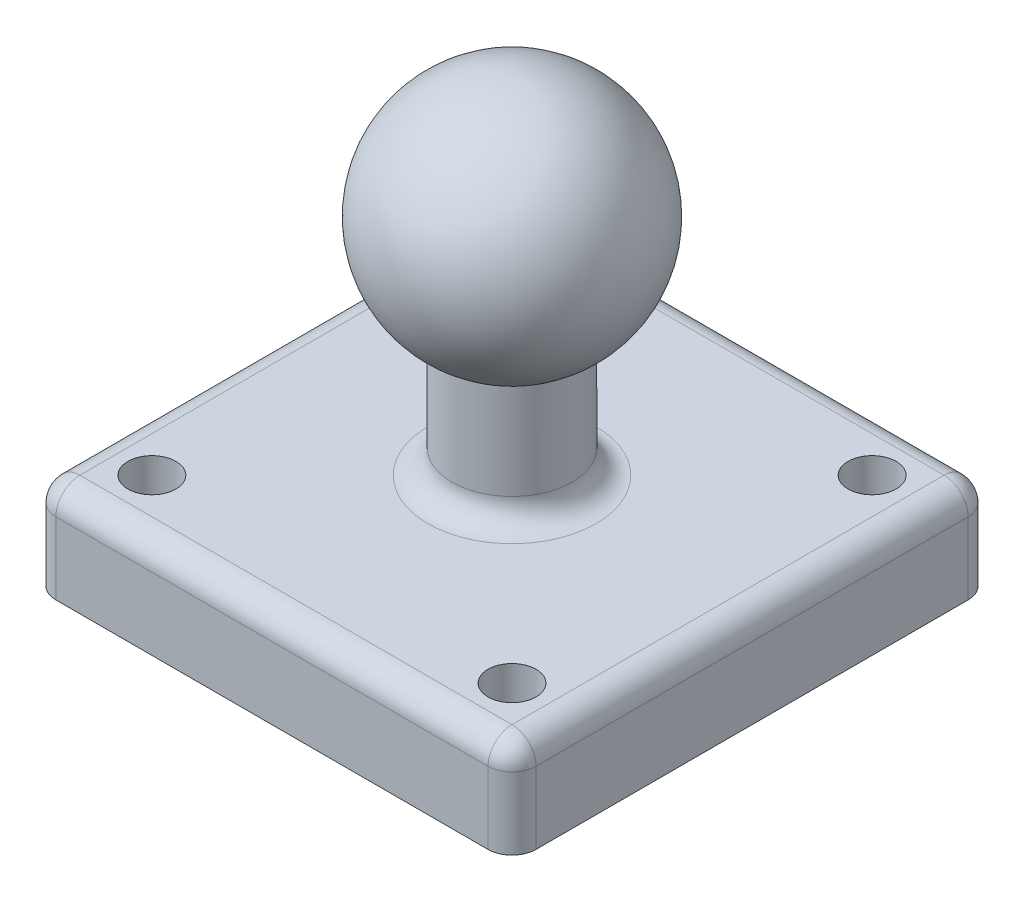
ISO-10303-21;
HEADER;
FILE_DESCRIPTION(('STEP AP214'),'2;1');
FILE_NAME('part.step','',(''),(''),'','','');
FILE_SCHEMA(('AUTOMOTIVE_DESIGN { 1 0 10303 214 1 1 1 1 }'));
ENDSEC;
DATA;
#1=APPLICATION_CONTEXT('core data for automotive mechanical design processes');
#2=APPLICATION_PROTOCOL_DEFINITION('international standard','automotive_design',2000,#1);
#3=PRODUCT_CONTEXT('',#1,'mechanical');
#4=PRODUCT('Part','Part','',(#3));
#5=PRODUCT_RELATED_PRODUCT_CATEGORY('part','',(#4));
#6=PRODUCT_DEFINITION_FORMATION('','',#4);
#7=PRODUCT_DEFINITION_CONTEXT('part definition',#1,'design');
#8=PRODUCT_DEFINITION('design','',#6,#7);
#9=PRODUCT_DEFINITION_SHAPE('','',#8);
#10=(LENGTH_UNIT() NAMED_UNIT(*) SI_UNIT(.MILLI.,.METRE.));
#11=(NAMED_UNIT(*) PLANE_ANGLE_UNIT() SI_UNIT($,.RADIAN.));
#12=(NAMED_UNIT(*) SI_UNIT($,.STERADIAN.) SOLID_ANGLE_UNIT());
#13=UNCERTAINTY_MEASURE_WITH_UNIT(LENGTH_MEASURE(1.E-05),#10,'distance_accuracy_value','');
#14=(GEOMETRIC_REPRESENTATION_CONTEXT(3) GLOBAL_UNCERTAINTY_ASSIGNED_CONTEXT((#13)) GLOBAL_UNIT_ASSIGNED_CONTEXT((#10,
#11,#12)) REPRESENTATION_CONTEXT('',''));
#15=CARTESIAN_POINT('',(0.,0.,0.));
#16=DIRECTION('',(0.,0.,1.));
#17=DIRECTION('',(1.,0.,0.));
#18=AXIS2_PLACEMENT_3D('',#15,#16,#17);
#19=CARTESIAN_POINT('',(0.,0.,0.));
#20=DIRECTION('',(0.,-1.,0.));
#21=DIRECTION('',(-1.,0.,0.));
#22=AXIS2_PLACEMENT_3D('',#19,#20,#21);
#23=SPHERICAL_SURFACE('',#22,5.);
#24=CARTESIAN_POINT('',(0.,-4.33012701892219,0.));
#25=DIRECTION('',(0.,-1.,0.));
#26=DIRECTION('',(1.,0.,0.));
#27=AXIS2_PLACEMENT_3D('',#24,#25,#26);
#28=CIRCLE('',#27,2.49999999999999);
#29=CARTESIAN_POINT('',(2.49999999999999,-4.33012701892219,0.));
#30=VERTEX_POINT('',#29);
#31=EDGE_CURVE('E234',#30,#30,#28,.T.);
#32=ORIENTED_EDGE('',*,*,#31,.F.);
#33=EDGE_LOOP('',(#32));
#34=FACE_BOUND('',#33,.T.);
#35=ADVANCED_FACE('F35',(#34),#23,.T.);
#36=CARTESIAN_POINT('',(0.,-9.33012701892219,0.));
#37=DIRECTION('',(0.,-1.,0.));
#38=DIRECTION('',(1.,0.,0.));
#39=AXIS2_PLACEMENT_3D('',#36,#37,#38);
#40=CYLINDRICAL_SURFACE('',#39,2.5);
#41=CARTESIAN_POINT('',(0.,-8.33012701892219,0.));
#42=DIRECTION('',(0.,-1.,0.));
#43=DIRECTION('',(1.,0.,0.));
#44=AXIS2_PLACEMENT_3D('',#41,#42,#43);
#45=CIRCLE('',#44,2.5);
#46=CARTESIAN_POINT('',(2.5,-8.33012701892219,0.));
#47=VERTEX_POINT('',#46);
#48=EDGE_CURVE('E172',#47,#47,#45,.F.);
#49=ORIENTED_EDGE('',*,*,#48,.T.);
#50=EDGE_LOOP('',(#49));
#51=FACE_BOUND('',#50,.T.);
#52=ORIENTED_EDGE('',*,*,#31,.T.);
#53=EDGE_LOOP('',(#52));
#54=FACE_BOUND('',#53,.T.);
#55=ADVANCED_FACE('F291',(#51,#54),#40,.T.);
#56=CARTESIAN_POINT('',(-9.99999999999999,-13.3301270189222,10.));
#57=DIRECTION('',(1.,0.,0.));
#58=DIRECTION('',(0.,1.,0.));
#59=AXIS2_PLACEMENT_3D('',#56,#57,#58);
#60=PLANE('',#59);
#61=DIRECTION('',(0.,0.,-1.));
#62=VECTOR('',#61,1.);
#63=CARTESIAN_POINT('',(-9.99999999999999,-13.3301270189222,10.));
#64=LINE('',#63,#62);
#65=CARTESIAN_POINT('',(-9.99999999999999,-13.3301270189222,9.));
#66=VERTEX_POINT('',#65);
#67=CARTESIAN_POINT('',(-9.99999999999999,-13.3301270189222,-9.));
#68=VERTEX_POINT('',#67);
#69=EDGE_CURVE('E116',#66,#68,#64,.T.);
#70=ORIENTED_EDGE('',*,*,#69,.F.);
#71=DIRECTION('',(0.,1.,0.));
#72=VECTOR('',#71,1.);
#73=CARTESIAN_POINT('',(-9.99999999999999,-13.3301270189222,9.));
#74=LINE('',#73,#72);
#75=CARTESIAN_POINT('',(-10.,-10.3301270189222,9.));
#76=VERTEX_POINT('',#75);
#77=EDGE_CURVE('E129',#66,#76,#74,.T.);
#78=ORIENTED_EDGE('',*,*,#77,.T.);
#79=DIRECTION('',(0.,0.,-1.));
#80=VECTOR('',#79,1.);
#81=CARTESIAN_POINT('',(-10.,-10.3301270189222,10.));
#82=LINE('',#81,#80);
#83=CARTESIAN_POINT('',(-10.,-10.3301270189222,-9.));
#84=VERTEX_POINT('',#83);
#85=EDGE_CURVE('E143',#76,#84,#82,.T.);
#86=ORIENTED_EDGE('',*,*,#85,.T.);
#87=DIRECTION('',(0.,1.,0.));
#88=VECTOR('',#87,1.);
#89=CARTESIAN_POINT('',(-9.99999999999999,-13.3301270189222,-9.));
#90=LINE('',#89,#88);
#91=EDGE_CURVE('E131',#84,#68,#90,.F.);
#92=ORIENTED_EDGE('',*,*,#91,.T.);
#93=EDGE_LOOP('',(#70,#78,#86,#92));
#94=FACE_BOUND('',#93,.T.);
#95=ADVANCED_FACE('F128',(#94),#60,.F.);
#96=CARTESIAN_POINT('',(-9.99999999999999,-13.3301270189222,-10.));
#97=DIRECTION('',(0.,0.,1.));
#98=DIRECTION('',(1.,0.,0.));
#99=AXIS2_PLACEMENT_3D('',#96,#97,#98);
#100=PLANE('',#99);
#101=DIRECTION('',(1.,0.,0.));
#102=VECTOR('',#101,1.);
#103=CARTESIAN_POINT('',(-9.99999999999999,-13.3301270189222,-10.));
#104=LINE('',#103,#102);
#105=CARTESIAN_POINT('',(-8.99999999999999,-13.3301270189222,-10.));
#106=VERTEX_POINT('',#105);
#107=CARTESIAN_POINT('',(9.00000000000001,-13.3301270189222,-10.));
#108=VERTEX_POINT('',#107);
#109=EDGE_CURVE('E132',#106,#108,#104,.T.);
#110=ORIENTED_EDGE('',*,*,#109,.F.);
#111=DIRECTION('',(0.,1.,0.));
#112=VECTOR('',#111,1.);
#113=CARTESIAN_POINT('',(-8.99999999999999,-13.3301270189222,-10.));
#114=LINE('',#113,#112);
#115=CARTESIAN_POINT('',(-9.,-10.3301270189222,-10.));
#116=VERTEX_POINT('',#115);
#117=EDGE_CURVE('E158',#106,#116,#114,.T.);
#118=ORIENTED_EDGE('',*,*,#117,.T.);
#119=DIRECTION('',(1.,0.,0.));
#120=VECTOR('',#119,1.);
#121=CARTESIAN_POINT('',(-10.,-10.3301270189222,-10.));
#122=LINE('',#121,#120);
#123=CARTESIAN_POINT('',(9.,-10.3301270189222,-10.));
#124=VERTEX_POINT('',#123);
#125=EDGE_CURVE('E156',#116,#124,#122,.T.);
#126=ORIENTED_EDGE('',*,*,#125,.T.);
#127=DIRECTION('',(0.,1.,0.));
#128=VECTOR('',#127,1.);
#129=CARTESIAN_POINT('',(9.00000000000001,-13.3301270189222,-10.));
#130=LINE('',#129,#128);
#131=EDGE_CURVE('E123',#124,#108,#130,.F.);
#132=ORIENTED_EDGE('',*,*,#131,.T.);
#133=EDGE_LOOP('',(#110,#118,#126,#132));
#134=FACE_BOUND('',#133,.T.);
#135=ADVANCED_FACE('F258',(#134),#100,.F.);
#136=CARTESIAN_POINT('',(10.,-13.3301270189222,10.));
#137=DIRECTION('',(-1.,0.,0.));
#138=DIRECTION('',(0.,-1.,0.));
#139=AXIS2_PLACEMENT_3D('',#136,#137,#138);
#140=PLANE('',#139);
#141=DIRECTION('',(0.,0.,1.));
#142=VECTOR('',#141,1.);
#143=CARTESIAN_POINT('',(10.,-13.3301270189222,10.));
#144=LINE('',#143,#142);
#145=CARTESIAN_POINT('',(10.,-13.3301270189222,-9.));
#146=VERTEX_POINT('',#145);
#147=CARTESIAN_POINT('',(10.,-13.3301270189222,9.));
#148=VERTEX_POINT('',#147);
#149=EDGE_CURVE('E230',#146,#148,#144,.T.);
#150=ORIENTED_EDGE('',*,*,#149,.F.);
#151=DIRECTION('',(0.,1.,0.));
#152=VECTOR('',#151,1.);
#153=CARTESIAN_POINT('',(10.,-13.3301270189222,-9.));
#154=LINE('',#153,#152);
#155=CARTESIAN_POINT('',(10.,-10.3301270189222,-9.));
#156=VERTEX_POINT('',#155);
#157=EDGE_CURVE('E11',#146,#156,#154,.T.);
#158=ORIENTED_EDGE('',*,*,#157,.T.);
#159=DIRECTION('',(0.,0.,1.));
#160=VECTOR('',#159,1.);
#161=CARTESIAN_POINT('',(10.,-10.3301270189222,10.));
#162=LINE('',#161,#160);
#163=CARTESIAN_POINT('',(10.,-10.3301270189222,9.));
#164=VERTEX_POINT('',#163);
#165=EDGE_CURVE('E51',#156,#164,#162,.T.);
#166=ORIENTED_EDGE('',*,*,#165,.T.);
#167=DIRECTION('',(0.,1.,0.));
#168=VECTOR('',#167,1.);
#169=CARTESIAN_POINT('',(10.,-13.3301270189222,9.));
#170=LINE('',#169,#168);
#171=EDGE_CURVE('E44',#164,#148,#170,.F.);
#172=ORIENTED_EDGE('',*,*,#171,.T.);
#173=EDGE_LOOP('',(#150,#158,#166,#172));
#174=FACE_BOUND('',#173,.T.);
#175=ADVANCED_FACE('F263',(#174),#140,.F.);
#176=CARTESIAN_POINT('',(-9.99999999999999,-13.3301270189222,10.));
#177=DIRECTION('',(0.,0.,-1.));
#178=DIRECTION('',(-1.,0.,0.));
#179=AXIS2_PLACEMENT_3D('',#176,#177,#178);
#180=PLANE('',#179);
#181=DIRECTION('',(-1.,0.,0.));
#182=VECTOR('',#181,1.);
#183=CARTESIAN_POINT('',(-10.,-10.3301270189222,10.));
#184=LINE('',#183,#182);
#185=CARTESIAN_POINT('',(9.,-10.3301270189222,10.));
#186=VERTEX_POINT('',#185);
#187=CARTESIAN_POINT('',(-9.,-10.3301270189222,10.));
#188=VERTEX_POINT('',#187);
#189=EDGE_CURVE('E139',#186,#188,#184,.T.);
#190=ORIENTED_EDGE('',*,*,#189,.T.);
#191=DIRECTION('',(0.,1.,0.));
#192=VECTOR('',#191,1.);
#193=CARTESIAN_POINT('',(-8.99999999999999,-13.3301270189222,10.));
#194=LINE('',#193,#192);
#195=CARTESIAN_POINT('',(-8.99999999999999,-13.3301270189222,10.));
#196=VERTEX_POINT('',#195);
#197=EDGE_CURVE('E148',#188,#196,#194,.F.);
#198=ORIENTED_EDGE('',*,*,#197,.T.);
#199=DIRECTION('',(-1.,0.,0.));
#200=VECTOR('',#199,1.);
#201=CARTESIAN_POINT('',(-9.99999999999999,-13.3301270189222,10.));
#202=LINE('',#201,#200);
#203=CARTESIAN_POINT('',(9.00000000000001,-13.3301270189222,10.));
#204=VERTEX_POINT('',#203);
#205=EDGE_CURVE('E119',#204,#196,#202,.T.);
#206=ORIENTED_EDGE('',*,*,#205,.F.);
#207=DIRECTION('',(0.,1.,0.));
#208=VECTOR('',#207,1.);
#209=CARTESIAN_POINT('',(9.00000000000001,-13.3301270189222,10.));
#210=LINE('',#209,#208);
#211=EDGE_CURVE('E141',#204,#186,#210,.T.);
#212=ORIENTED_EDGE('',*,*,#211,.T.);
#213=EDGE_LOOP('',(#190,#198,#206,#212));
#214=FACE_BOUND('',#213,.T.);
#215=ADVANCED_FACE('F279',(#214),#180,.F.);
#216=CARTESIAN_POINT('',(0.,-13.3301270189222,0.));
#217=DIRECTION('',(0.,-1.,0.));
#218=DIRECTION('',(1.,0.,0.));
#219=AXIS2_PLACEMENT_3D('',#216,#217,#218);
#220=PLANE('',#219);
#221=CARTESIAN_POINT('',(-7.49999999999998,-13.3301270189222,7.5));
#222=DIRECTION('',(0.,-1.,0.));
#223=DIRECTION('',(1.,0.,0.));
#224=AXIS2_PLACEMENT_3D('',#221,#222,#223);
#225=CIRCLE('',#224,1.);
#226=CARTESIAN_POINT('',(-6.49999999999998,-13.3301270189222,7.5));
#227=VERTEX_POINT('',#226);
#228=EDGE_CURVE('E209',#227,#227,#225,.F.);
#229=ORIENTED_EDGE('',*,*,#228,.T.);
#230=EDGE_LOOP('',(#229));
#231=FACE_BOUND('',#230,.T.);
#232=CARTESIAN_POINT('',(-7.49999999999998,-13.3301270189222,-7.5));
#233=DIRECTION('',(0.,-1.,0.));
#234=DIRECTION('',(1.,0.,0.));
#235=AXIS2_PLACEMENT_3D('',#232,#233,#234);
#236=CIRCLE('',#235,1.);
#237=CARTESIAN_POINT('',(-6.49999999999998,-13.3301270189222,-7.5));
#238=VERTEX_POINT('',#237);
#239=EDGE_CURVE('E218',#238,#238,#236,.F.);
#240=ORIENTED_EDGE('',*,*,#239,.T.);
#241=EDGE_LOOP('',(#240));
#242=FACE_BOUND('',#241,.T.);
#243=CARTESIAN_POINT('',(7.50000000000002,-13.3301270189222,-7.5));
#244=DIRECTION('',(0.,-1.,0.));
#245=DIRECTION('',(1.,0.,0.));
#246=AXIS2_PLACEMENT_3D('',#243,#244,#245);
#247=CIRCLE('',#246,1.);
#248=CARTESIAN_POINT('',(8.50000000000002,-13.3301270189222,-7.5));
#249=VERTEX_POINT('',#248);
#250=EDGE_CURVE('E334',#249,#249,#247,.F.);
#251=ORIENTED_EDGE('',*,*,#250,.T.);
#252=EDGE_LOOP('',(#251));
#253=FACE_BOUND('',#252,.T.);
#254=CARTESIAN_POINT('',(7.50000000000002,-13.3301270189222,7.5));
#255=DIRECTION('',(0.,-1.,0.));
#256=DIRECTION('',(1.,0.,0.));
#257=AXIS2_PLACEMENT_3D('',#254,#255,#256);
#258=CIRCLE('',#257,1.);
#259=CARTESIAN_POINT('',(8.50000000000002,-13.3301270189222,7.5));
#260=VERTEX_POINT('',#259);
#261=EDGE_CURVE('E224',#260,#260,#258,.F.);
#262=ORIENTED_EDGE('',*,*,#261,.T.);
#263=EDGE_LOOP('',(#262));
#264=FACE_BOUND('',#263,.T.);
#265=ORIENTED_EDGE('',*,*,#205,.T.);
#266=CARTESIAN_POINT('',(-8.99999999999999,-13.3301270189222,9.));
#267=DIRECTION('',(0.,-1.,0.));
#268=DIRECTION('',(1.,0.,0.));
#269=AXIS2_PLACEMENT_3D('',#266,#267,#268);
#270=CIRCLE('',#269,1.);
#271=EDGE_CURVE('E113',#196,#66,#270,.T.);
#272=ORIENTED_EDGE('',*,*,#271,.T.);
#273=ORIENTED_EDGE('',*,*,#69,.T.);
#274=CARTESIAN_POINT('',(-8.99999999999999,-13.3301270189222,-9.));
#275=DIRECTION('',(0.,-1.,0.));
#276=DIRECTION('',(1.,0.,0.));
#277=AXIS2_PLACEMENT_3D('',#274,#275,#276);
#278=CIRCLE('',#277,1.);
#279=EDGE_CURVE('E124',#68,#106,#278,.T.);
#280=ORIENTED_EDGE('',*,*,#279,.T.);
#281=ORIENTED_EDGE('',*,*,#109,.T.);
#282=CARTESIAN_POINT('',(9.00000000000001,-13.3301270189222,-9.));
#283=DIRECTION('',(0.,-1.,0.));
#284=DIRECTION('',(1.,0.,0.));
#285=AXIS2_PLACEMENT_3D('',#282,#283,#284);
#286=CIRCLE('',#285,1.);
#287=EDGE_CURVE('E152',#108,#146,#286,.T.);
#288=ORIENTED_EDGE('',*,*,#287,.T.);
#289=ORIENTED_EDGE('',*,*,#149,.T.);
#290=CARTESIAN_POINT('',(9.00000000000001,-13.3301270189222,9.));
#291=DIRECTION('',(0.,-1.,0.));
#292=DIRECTION('',(1.,0.,0.));
#293=AXIS2_PLACEMENT_3D('',#290,#291,#292);
#294=CIRCLE('',#293,1.);
#295=EDGE_CURVE('E150',#148,#204,#294,.T.);
#296=ORIENTED_EDGE('',*,*,#295,.T.);
#297=EDGE_LOOP('',(#265,#272,#273,#280,#281,#288,#289,#296));
#298=FACE_BOUND('',#297,.T.);
#299=ADVANCED_FACE('F115',(#231,#242,#253,#264,#298),#220,.T.);
#300=CARTESIAN_POINT('',(0.,-9.33012701892219,0.));
#301=DIRECTION('',(0.,-1.,0.));
#302=DIRECTION('',(1.,0.,0.));
#303=AXIS2_PLACEMENT_3D('',#300,#301,#302);
#304=PLANE('',#303);
#305=CARTESIAN_POINT('',(0.,-9.33012701892219,0.));
#306=DIRECTION('',(0.,-1.,0.));
#307=DIRECTION('',(1.,0.,0.));
#308=AXIS2_PLACEMENT_3D('',#305,#306,#307);
#309=CIRCLE('',#308,3.5);
#310=CARTESIAN_POINT('',(3.5,-9.33012701892219,0.));
#311=VERTEX_POINT('',#310);
#312=EDGE_CURVE('E169',#311,#311,#309,.T.);
#313=ORIENTED_EDGE('',*,*,#312,.T.);
#314=EDGE_LOOP('',(#313));
#315=FACE_BOUND('',#314,.T.);
#316=DIRECTION('',(1.,0.,0.));
#317=VECTOR('',#316,1.);
#318=CARTESIAN_POINT('',(0.,-9.33012701892219,-9.));
#319=LINE('',#318,#317);
#320=CARTESIAN_POINT('',(9.,-9.33012701892218,-9.));
#321=VERTEX_POINT('',#320);
#322=CARTESIAN_POINT('',(-9.,-9.3301270189222,-9.));
#323=VERTEX_POINT('',#322);
#324=EDGE_CURVE('E164',#321,#323,#319,.F.);
#325=ORIENTED_EDGE('',*,*,#324,.T.);
#326=DIRECTION('',(0.,0.,-1.));
#327=VECTOR('',#326,1.);
#328=CARTESIAN_POINT('',(-9.,-9.3301270189222,0.));
#329=LINE('',#328,#327);
#330=CARTESIAN_POINT('',(-9.,-9.3301270189222,9.));
#331=VERTEX_POINT('',#330);
#332=EDGE_CURVE('E166',#323,#331,#329,.F.);
#333=ORIENTED_EDGE('',*,*,#332,.T.);
#334=DIRECTION('',(-1.,0.,0.));
#335=VECTOR('',#334,1.);
#336=CARTESIAN_POINT('',(0.,-9.33012701892219,9.));
#337=LINE('',#336,#335);
#338=CARTESIAN_POINT('',(9.,-9.33012701892218,9.));
#339=VERTEX_POINT('',#338);
#340=EDGE_CURVE('E162',#331,#339,#337,.F.);
#341=ORIENTED_EDGE('',*,*,#340,.T.);
#342=DIRECTION('',(0.,0.,1.));
#343=VECTOR('',#342,1.);
#344=CARTESIAN_POINT('',(9.,-9.33012701892218,0.));
#345=LINE('',#344,#343);
#346=EDGE_CURVE('E160',#339,#321,#345,.F.);
#347=ORIENTED_EDGE('',*,*,#346,.T.);
#348=EDGE_LOOP('',(#325,#333,#341,#347));
#349=FACE_BOUND('',#348,.T.);
#350=CARTESIAN_POINT('',(-7.49999999999999,-9.3301270189222,7.5));
#351=DIRECTION('',(0.,1.,0.));
#352=DIRECTION('',(-1.,0.,0.));
#353=AXIS2_PLACEMENT_3D('',#350,#351,#352);
#354=CIRCLE('',#353,1.);
#355=CARTESIAN_POINT('',(-8.49999999999999,-9.3301270189222,7.5));
#356=VERTEX_POINT('',#355);
#357=EDGE_CURVE('E213',#356,#356,#354,.T.);
#358=ORIENTED_EDGE('',*,*,#357,.F.);
#359=EDGE_LOOP('',(#358));
#360=FACE_BOUND('',#359,.T.);
#361=CARTESIAN_POINT('',(-7.49999999999999,-9.3301270189222,-7.5));
#362=DIRECTION('',(0.,1.,0.));
#363=DIRECTION('',(-1.,0.,0.));
#364=AXIS2_PLACEMENT_3D('',#361,#362,#363);
#365=CIRCLE('',#364,1.);
#366=CARTESIAN_POINT('',(-8.49999999999999,-9.3301270189222,-7.5));
#367=VERTEX_POINT('',#366);
#368=EDGE_CURVE('E339',#367,#367,#365,.T.);
#369=ORIENTED_EDGE('',*,*,#368,.F.);
#370=EDGE_LOOP('',(#369));
#371=FACE_BOUND('',#370,.T.);
#372=CARTESIAN_POINT('',(7.50000000000001,-9.33012701892218,-7.5));
#373=DIRECTION('',(0.,1.,0.));
#374=DIRECTION('',(-1.,0.,0.));
#375=AXIS2_PLACEMENT_3D('',#372,#373,#374);
#376=CIRCLE('',#375,1.);
#377=CARTESIAN_POINT('',(6.50000000000001,-9.33012701892219,-7.5));
#378=VERTEX_POINT('',#377);
#379=EDGE_CURVE('E226',#378,#378,#376,.T.);
#380=ORIENTED_EDGE('',*,*,#379,.F.);
#381=EDGE_LOOP('',(#380));
#382=FACE_BOUND('',#381,.T.);
#383=CARTESIAN_POINT('',(7.50000000000001,-9.33012701892218,7.5));
#384=DIRECTION('',(0.,1.,0.));
#385=DIRECTION('',(-1.,0.,0.));
#386=AXIS2_PLACEMENT_3D('',#383,#384,#385);
#387=CIRCLE('',#386,1.);
#388=CARTESIAN_POINT('',(6.50000000000001,-9.33012701892219,7.5));
#389=VERTEX_POINT('',#388);
#390=EDGE_CURVE('E133',#389,#389,#387,.T.);
#391=ORIENTED_EDGE('',*,*,#390,.F.);
#392=EDGE_LOOP('',(#391));
#393=FACE_BOUND('',#392,.T.);
#394=ADVANCED_FACE('F251',(#315,#349,#360,#371,#382,#393),#304,.F.);
#395=CARTESIAN_POINT('',(7.50000000000002,-13.3311270189222,7.5));
#396=DIRECTION('',(0.,1.,0.));
#397=DIRECTION('',(-1.,0.,0.));
#398=AXIS2_PLACEMENT_3D('',#395,#396,#397);
#399=CYLINDRICAL_SURFACE('',#398,1.);
#400=ORIENTED_EDGE('',*,*,#261,.F.);
#401=EDGE_LOOP('',(#400));
#402=FACE_BOUND('',#401,.T.);
#403=ORIENTED_EDGE('',*,*,#390,.T.);
#404=EDGE_LOOP('',(#403));
#405=FACE_BOUND('',#404,.T.);
#406=ADVANCED_FACE('F311',(#402,#405),#399,.F.);
#407=CARTESIAN_POINT('',(7.50000000000002,-13.3311270189222,-7.5));
#408=DIRECTION('',(0.,1.,0.));
#409=DIRECTION('',(-1.,0.,0.));
#410=AXIS2_PLACEMENT_3D('',#407,#408,#409);
#411=CYLINDRICAL_SURFACE('',#410,1.);
#412=ORIENTED_EDGE('',*,*,#250,.F.);
#413=EDGE_LOOP('',(#412));
#414=FACE_BOUND('',#413,.T.);
#415=ORIENTED_EDGE('',*,*,#379,.T.);
#416=EDGE_LOOP('',(#415));
#417=FACE_BOUND('',#416,.T.);
#418=ADVANCED_FACE('F317',(#414,#417),#411,.F.);
#419=CARTESIAN_POINT('',(-7.49999999999998,-13.3311270189222,-7.5));
#420=DIRECTION('',(0.,1.,0.));
#421=DIRECTION('',(-1.,0.,0.));
#422=AXIS2_PLACEMENT_3D('',#419,#420,#421);
#423=CYLINDRICAL_SURFACE('',#422,1.);
#424=ORIENTED_EDGE('',*,*,#239,.F.);
#425=EDGE_LOOP('',(#424));
#426=FACE_BOUND('',#425,.T.);
#427=ORIENTED_EDGE('',*,*,#368,.T.);
#428=EDGE_LOOP('',(#427));
#429=FACE_BOUND('',#428,.T.);
#430=ADVANCED_FACE('F322',(#426,#429),#423,.F.);
#431=CARTESIAN_POINT('',(-7.49999999999998,-13.3311270189222,7.5));
#432=DIRECTION('',(0.,1.,0.));
#433=DIRECTION('',(-1.,0.,0.));
#434=AXIS2_PLACEMENT_3D('',#431,#432,#433);
#435=CYLINDRICAL_SURFACE('',#434,1.);
#436=ORIENTED_EDGE('',*,*,#228,.F.);
#437=EDGE_LOOP('',(#436));
#438=FACE_BOUND('',#437,.T.);
#439=ORIENTED_EDGE('',*,*,#357,.T.);
#440=EDGE_LOOP('',(#439));
#441=FACE_BOUND('',#440,.T.);
#442=ADVANCED_FACE('F319',(#438,#441),#435,.F.);
#443=CARTESIAN_POINT('',(9.00000000000001,-13.3301270189222,-9.));
#444=DIRECTION('',(0.,1.,0.));
#445=DIRECTION('',(-1.,0.,0.));
#446=AXIS2_PLACEMENT_3D('',#443,#444,#445);
#447=CYLINDRICAL_SURFACE('',#446,1.);
#448=CARTESIAN_POINT('',(9.00000000000001,-10.3301270189222,-9.));
#449=DIRECTION('',(0.,1.,0.));
#450=DIRECTION('',(-1.,0.,0.));
#451=AXIS2_PLACEMENT_3D('',#448,#449,#450);
#452=CIRCLE('',#451,1.);
#453=EDGE_CURVE('E39',#156,#124,#452,.T.);
#454=ORIENTED_EDGE('',*,*,#453,.F.);
#455=ORIENTED_EDGE('',*,*,#157,.F.);
#456=ORIENTED_EDGE('',*,*,#287,.F.);
#457=ORIENTED_EDGE('',*,*,#131,.F.);
#458=EDGE_LOOP('',(#454,#455,#456,#457));
#459=FACE_BOUND('',#458,.T.);
#460=ADVANCED_FACE('F261',(#459),#447,.T.);
#461=CARTESIAN_POINT('',(9.,-10.3301270189222,-9.));
#462=DIRECTION('',(0.,0.,1.));
#463=DIRECTION('',(1.,0.,0.));
#464=AXIS2_PLACEMENT_3D('',#461,#462,#463);
#465=SPHERICAL_SURFACE('',#464,1.);
#466=CARTESIAN_POINT('',(9.,-10.3301270189222,-9.));
#467=DIRECTION('',(0.,0.,-1.));
#468=DIRECTION('',(-1.,0.,0.));
#469=AXIS2_PLACEMENT_3D('',#466,#467,#468);
#470=CIRCLE('',#469,1.);
#471=EDGE_CURVE('E200',#156,#321,#470,.F.);
#472=ORIENTED_EDGE('',*,*,#471,.F.);
#473=ORIENTED_EDGE('',*,*,#453,.T.);
#474=CARTESIAN_POINT('',(9.,-10.3301270189222,-9.));
#475=DIRECTION('',(1.,0.,0.));
#476=DIRECTION('',(0.,1.,0.));
#477=AXIS2_PLACEMENT_3D('',#474,#475,#476);
#478=CIRCLE('',#477,1.);
#479=EDGE_CURVE('E202',#321,#124,#478,.F.);
#480=ORIENTED_EDGE('',*,*,#479,.F.);
#481=EDGE_LOOP('',(#472,#473,#480));
#482=FACE_BOUND('',#481,.T.);
#483=ADVANCED_FACE('F372',(#482),#465,.T.);
#484=CARTESIAN_POINT('',(-8.99999999999999,-13.3301270189222,-9.));
#485=DIRECTION('',(0.,1.,0.));
#486=DIRECTION('',(-1.,0.,0.));
#487=AXIS2_PLACEMENT_3D('',#484,#485,#486);
#488=CYLINDRICAL_SURFACE('',#487,1.);
#489=ORIENTED_EDGE('',*,*,#279,.F.);
#490=ORIENTED_EDGE('',*,*,#91,.F.);
#491=CARTESIAN_POINT('',(-9.,-10.3301270189222,-9.));
#492=DIRECTION('',(0.,1.,0.));
#493=DIRECTION('',(-1.,0.,0.));
#494=AXIS2_PLACEMENT_3D('',#491,#492,#493);
#495=CIRCLE('',#494,1.);
#496=EDGE_CURVE('E197',#116,#84,#495,.T.);
#497=ORIENTED_EDGE('',*,*,#496,.F.);
#498=ORIENTED_EDGE('',*,*,#117,.F.);
#499=EDGE_LOOP('',(#489,#490,#497,#498));
#500=FACE_BOUND('',#499,.T.);
#501=ADVANCED_FACE('F241',(#500),#488,.T.);
#502=CARTESIAN_POINT('',(-10.,-10.3301270189222,-9.));
#503=DIRECTION('',(1.,0.,0.));
#504=DIRECTION('',(0.,1.,0.));
#505=AXIS2_PLACEMENT_3D('',#502,#503,#504);
#506=CYLINDRICAL_SURFACE('',#505,1.);
#507=ORIENTED_EDGE('',*,*,#479,.T.);
#508=ORIENTED_EDGE('',*,*,#125,.F.);
#509=CARTESIAN_POINT('',(-9.,-10.3301270189222,-9.));
#510=DIRECTION('',(-1.,0.,0.));
#511=DIRECTION('',(0.,-1.,0.));
#512=AXIS2_PLACEMENT_3D('',#509,#510,#511);
#513=CIRCLE('',#512,1.);
#514=EDGE_CURVE('E194',#323,#116,#513,.T.);
#515=ORIENTED_EDGE('',*,*,#514,.F.);
#516=ORIENTED_EDGE('',*,*,#324,.F.);
#517=EDGE_LOOP('',(#507,#508,#515,#516));
#518=FACE_BOUND('',#517,.T.);
#519=ADVANCED_FACE('F254',(#518),#506,.T.);
#520=CARTESIAN_POINT('',(9.,-10.3301270189222,10.));
#521=DIRECTION('',(0.,0.,1.));
#522=DIRECTION('',(1.,0.,0.));
#523=AXIS2_PLACEMENT_3D('',#520,#521,#522);
#524=CYLINDRICAL_SURFACE('',#523,1.);
#525=ORIENTED_EDGE('',*,*,#471,.T.);
#526=ORIENTED_EDGE('',*,*,#346,.F.);
#527=CARTESIAN_POINT('',(9.,-10.3301270189222,9.));
#528=DIRECTION('',(0.,0.,1.));
#529=DIRECTION('',(1.,0.,0.));
#530=AXIS2_PLACEMENT_3D('',#527,#528,#529);
#531=CIRCLE('',#530,1.);
#532=EDGE_CURVE('E191',#164,#339,#531,.T.);
#533=ORIENTED_EDGE('',*,*,#532,.F.);
#534=ORIENTED_EDGE('',*,*,#165,.F.);
#535=EDGE_LOOP('',(#525,#526,#533,#534));
#536=FACE_BOUND('',#535,.T.);
#537=ADVANCED_FACE('F271',(#536),#524,.T.);
#538=CARTESIAN_POINT('',(9.00000000000001,-13.3301270189222,9.));
#539=DIRECTION('',(0.,1.,0.));
#540=DIRECTION('',(-1.,0.,0.));
#541=AXIS2_PLACEMENT_3D('',#538,#539,#540);
#542=CYLINDRICAL_SURFACE('',#541,1.);
#543=ORIENTED_EDGE('',*,*,#295,.F.);
#544=ORIENTED_EDGE('',*,*,#171,.F.);
#545=CARTESIAN_POINT('',(9.,-10.3301270189222,9.));
#546=DIRECTION('',(0.,1.,0.));
#547=DIRECTION('',(-1.,0.,0.));
#548=AXIS2_PLACEMENT_3D('',#545,#546,#547);
#549=CIRCLE('',#548,1.);
#550=EDGE_CURVE('E188',#186,#164,#549,.T.);
#551=ORIENTED_EDGE('',*,*,#550,.F.);
#552=ORIENTED_EDGE('',*,*,#211,.F.);
#553=EDGE_LOOP('',(#543,#544,#551,#552));
#554=FACE_BOUND('',#553,.T.);
#555=ADVANCED_FACE('F267',(#554),#542,.T.);
#556=CARTESIAN_POINT('',(-9.,-10.3301270189222,-9.));
#557=DIRECTION('',(0.,0.,1.));
#558=DIRECTION('',(1.,0.,0.));
#559=AXIS2_PLACEMENT_3D('',#556,#557,#558);
#560=SPHERICAL_SURFACE('',#559,1.);
#561=ORIENTED_EDGE('',*,*,#514,.T.);
#562=ORIENTED_EDGE('',*,*,#496,.T.);
#563=CARTESIAN_POINT('',(-9.,-10.3301270189222,-9.));
#564=DIRECTION('',(0.,0.,-1.));
#565=DIRECTION('',(-1.,0.,0.));
#566=AXIS2_PLACEMENT_3D('',#563,#564,#565);
#567=CIRCLE('',#566,1.);
#568=EDGE_CURVE('E185',#323,#84,#567,.F.);
#569=ORIENTED_EDGE('',*,*,#568,.F.);
#570=EDGE_LOOP('',(#561,#562,#569));
#571=FACE_BOUND('',#570,.T.);
#572=ADVANCED_FACE('F245',(#571),#560,.T.);
#573=CARTESIAN_POINT('',(9.,-10.3301270189222,9.));
#574=DIRECTION('',(0.,0.,1.));
#575=DIRECTION('',(1.,0.,0.));
#576=AXIS2_PLACEMENT_3D('',#573,#574,#575);
#577=SPHERICAL_SURFACE('',#576,1.);
#578=ORIENTED_EDGE('',*,*,#550,.T.);
#579=ORIENTED_EDGE('',*,*,#532,.T.);
#580=CARTESIAN_POINT('',(9.,-10.3301270189222,9.));
#581=DIRECTION('',(1.,0.,0.));
#582=DIRECTION('',(0.,1.,0.));
#583=AXIS2_PLACEMENT_3D('',#580,#581,#582);
#584=CIRCLE('',#583,1.);
#585=EDGE_CURVE('E182',#186,#339,#584,.F.);
#586=ORIENTED_EDGE('',*,*,#585,.F.);
#587=EDGE_LOOP('',(#578,#579,#586));
#588=FACE_BOUND('',#587,.T.);
#589=ADVANCED_FACE('F273',(#588),#577,.T.);
#590=CARTESIAN_POINT('',(-9.,-10.3301270189222,10.));
#591=DIRECTION('',(0.,0.,-1.));
#592=DIRECTION('',(-1.,0.,0.));
#593=AXIS2_PLACEMENT_3D('',#590,#591,#592);
#594=CYLINDRICAL_SURFACE('',#593,1.);
#595=ORIENTED_EDGE('',*,*,#568,.T.);
#596=ORIENTED_EDGE('',*,*,#85,.F.);
#597=CARTESIAN_POINT('',(-9.,-10.3301270189222,9.));
#598=DIRECTION('',(0.,0.,1.));
#599=DIRECTION('',(1.,0.,0.));
#600=AXIS2_PLACEMENT_3D('',#597,#598,#599);
#601=CIRCLE('',#600,1.);
#602=EDGE_CURVE('E180',#331,#76,#601,.T.);
#603=ORIENTED_EDGE('',*,*,#602,.F.);
#604=ORIENTED_EDGE('',*,*,#332,.F.);
#605=EDGE_LOOP('',(#595,#596,#603,#604));
#606=FACE_BOUND('',#605,.T.);
#607=ADVANCED_FACE('F248',(#606),#594,.T.);
#608=CARTESIAN_POINT('',(-10.,-10.3301270189222,9.));
#609=DIRECTION('',(-1.,0.,0.));
#610=DIRECTION('',(0.,-1.,0.));
#611=AXIS2_PLACEMENT_3D('',#608,#609,#610);
#612=CYLINDRICAL_SURFACE('',#611,1.);
#613=ORIENTED_EDGE('',*,*,#585,.T.);
#614=ORIENTED_EDGE('',*,*,#340,.F.);
#615=CARTESIAN_POINT('',(-9.,-10.3301270189222,9.));
#616=DIRECTION('',(-1.,0.,0.));
#617=DIRECTION('',(0.,-1.,0.));
#618=AXIS2_PLACEMENT_3D('',#615,#616,#617);
#619=CIRCLE('',#618,1.);
#620=EDGE_CURVE('E178',#188,#331,#619,.T.);
#621=ORIENTED_EDGE('',*,*,#620,.F.);
#622=ORIENTED_EDGE('',*,*,#189,.F.);
#623=EDGE_LOOP('',(#613,#614,#621,#622));
#624=FACE_BOUND('',#623,.T.);
#625=ADVANCED_FACE('F277',(#624),#612,.T.);
#626=CARTESIAN_POINT('',(-9.,-10.3301270189222,9.));
#627=DIRECTION('',(0.,0.,1.));
#628=DIRECTION('',(1.,0.,0.));
#629=AXIS2_PLACEMENT_3D('',#626,#627,#628);
#630=SPHERICAL_SURFACE('',#629,1.);
#631=ORIENTED_EDGE('',*,*,#620,.T.);
#632=ORIENTED_EDGE('',*,*,#602,.T.);
#633=CARTESIAN_POINT('',(-9.,-10.3301270189222,9.));
#634=DIRECTION('',(0.,1.,0.));
#635=DIRECTION('',(-1.,0.,0.));
#636=AXIS2_PLACEMENT_3D('',#633,#634,#635);
#637=CIRCLE('',#636,1.);
#638=EDGE_CURVE('E137',#188,#76,#637,.F.);
#639=ORIENTED_EDGE('',*,*,#638,.F.);
#640=EDGE_LOOP('',(#631,#632,#639));
#641=FACE_BOUND('',#640,.T.);
#642=ADVANCED_FACE('F281',(#641),#630,.T.);
#643=CARTESIAN_POINT('',(-8.99999999999999,-13.3301270189222,9.));
#644=DIRECTION('',(0.,1.,0.));
#645=DIRECTION('',(-1.,0.,0.));
#646=AXIS2_PLACEMENT_3D('',#643,#644,#645);
#647=CYLINDRICAL_SURFACE('',#646,1.);
#648=ORIENTED_EDGE('',*,*,#271,.F.);
#649=ORIENTED_EDGE('',*,*,#197,.F.);
#650=ORIENTED_EDGE('',*,*,#638,.T.);
#651=ORIENTED_EDGE('',*,*,#77,.F.);
#652=EDGE_LOOP('',(#648,#649,#650,#651));
#653=FACE_BOUND('',#652,.T.);
#654=ADVANCED_FACE('F135',(#653),#647,.T.);
#655=CARTESIAN_POINT('',(0.,-8.33012701892219,0.));
#656=DIRECTION('',(0.,-1.,0.));
#657=DIRECTION('',(1.,0.,0.));
#658=AXIS2_PLACEMENT_3D('',#655,#656,#657);
#659=TOROIDAL_SURFACE('',#658,3.5,1.);
#660=ORIENTED_EDGE('',*,*,#48,.F.);
#661=EDGE_LOOP('',(#660));
#662=FACE_BOUND('',#661,.T.);
#663=ORIENTED_EDGE('',*,*,#312,.F.);
#664=EDGE_LOOP('',(#663));
#665=FACE_BOUND('',#664,.T.);
#666=ADVANCED_FACE('F37',(#662,#665),#659,.F.);
#667=CLOSED_SHELL('',(#35,#55,#95,#135,#175,#215,#299,#394,#406,#418,#430,#442,#460,#483,#501,
#519,#537,#555,#572,#589,#607,#625,#642,#654,#666));
#668=MANIFOLD_SOLID_BREP('B2',#667);
#669=ADVANCED_BREP_SHAPE_REPRESENTATION('',(#18,#668),#14);
#670=SHAPE_DEFINITION_REPRESENTATION(#9,#669);
ENDSEC;
END-ISO-10303-21;
